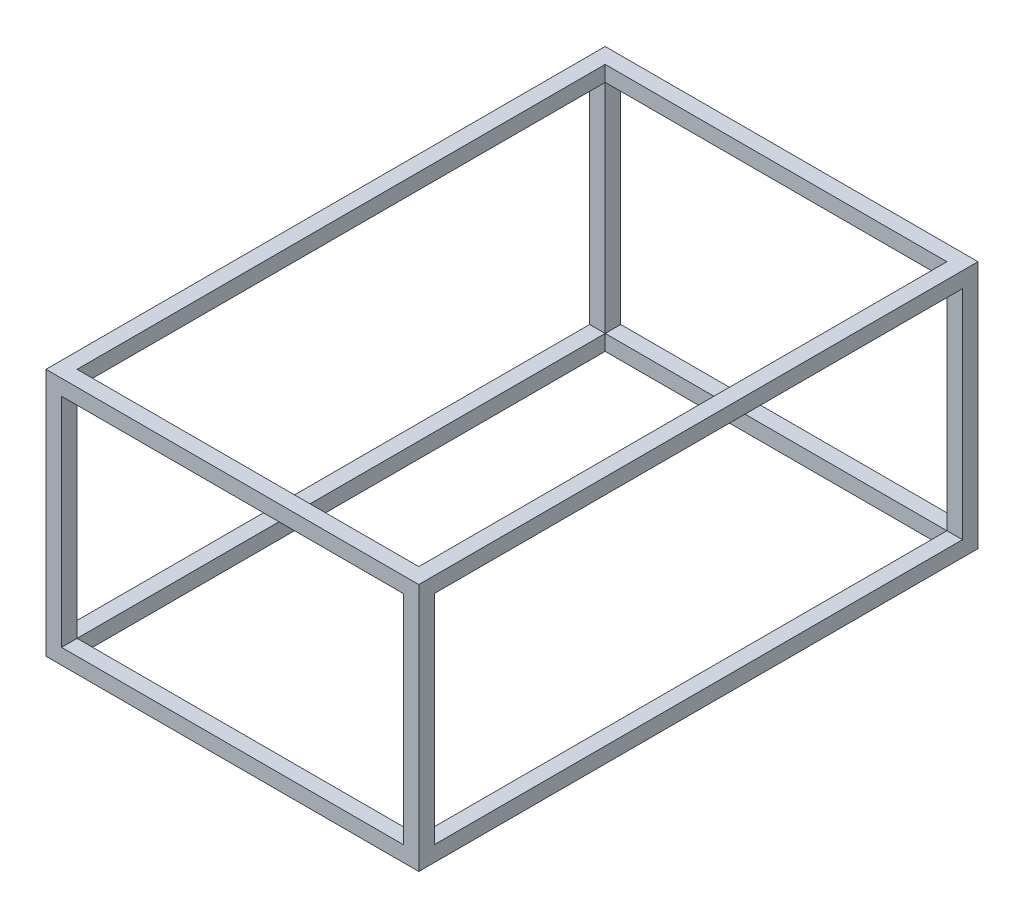
ISO-10303-21;
HEADER;
FILE_DESCRIPTION(('STEP AP214'),'2;1');
FILE_NAME('part.step','',(''),(''),'','','');
FILE_SCHEMA(('AUTOMOTIVE_DESIGN { 1 0 10303 214 1 1 1 1 }'));
ENDSEC;
DATA;
#1=APPLICATION_CONTEXT('core data for automotive mechanical design processes');
#2=APPLICATION_PROTOCOL_DEFINITION('international standard','automotive_design',2000,#1);
#3=PRODUCT_CONTEXT('',#1,'mechanical');
#4=PRODUCT('Part','Part','',(#3));
#5=PRODUCT_RELATED_PRODUCT_CATEGORY('part','',(#4));
#6=PRODUCT_DEFINITION_FORMATION('','',#4);
#7=PRODUCT_DEFINITION_CONTEXT('part definition',#1,'design');
#8=PRODUCT_DEFINITION('design','',#6,#7);
#9=PRODUCT_DEFINITION_SHAPE('','',#8);
#10=(LENGTH_UNIT() NAMED_UNIT(*) SI_UNIT(.MILLI.,.METRE.));
#11=(NAMED_UNIT(*) PLANE_ANGLE_UNIT() SI_UNIT($,.RADIAN.));
#12=(NAMED_UNIT(*) SI_UNIT($,.STERADIAN.) SOLID_ANGLE_UNIT());
#13=UNCERTAINTY_MEASURE_WITH_UNIT(LENGTH_MEASURE(1.E-05),#10,'distance_accuracy_value','');
#14=(GEOMETRIC_REPRESENTATION_CONTEXT(3) GLOBAL_UNCERTAINTY_ASSIGNED_CONTEXT((#13)) GLOBAL_UNIT_ASSIGNED_CONTEXT((#10,
#11,#12)) REPRESENTATION_CONTEXT('',''));
#15=CARTESIAN_POINT('',(0.,0.,0.));
#16=DIRECTION('',(0.,0.,1.));
#17=DIRECTION('',(1.,0.,0.));
#18=AXIS2_PLACEMENT_3D('',#15,#16,#17);
#19=CARTESIAN_POINT('',(-584.2,393.7,-25.4));
#20=DIRECTION('',(0.,0.,1.));
#21=DIRECTION('',(1.,0.,0.));
#22=AXIS2_PLACEMENT_3D('',#19,#20,#21);
#23=PLANE('',#22);
#24=DIRECTION('',(-1.,0.,0.));
#25=VECTOR('',#24,1.);
#26=CARTESIAN_POINT('',(-584.2,368.3,-25.4));
#27=LINE('',#26,#25);
#28=CARTESIAN_POINT('',(-584.2,368.3,-25.4));
#29=VERTEX_POINT('',#28);
#30=CARTESIAN_POINT('',(-609.6,368.3,-25.4));
#31=VERTEX_POINT('',#30);
#32=EDGE_CURVE('E398',#29,#31,#27,.T.);
#33=ORIENTED_EDGE('',*,*,#32,.F.);
#34=DIRECTION('',(0.,-1.,0.));
#35=VECTOR('',#34,1.);
#36=CARTESIAN_POINT('',(-584.2,393.7,-25.4));
#37=LINE('',#36,#35);
#38=CARTESIAN_POINT('',(-584.2,12.7,-25.4));
#39=VERTEX_POINT('',#38);
#40=EDGE_CURVE('E266',#29,#39,#37,.T.);
#41=ORIENTED_EDGE('',*,*,#40,.T.);
#42=DIRECTION('',(-1.,0.,0.));
#43=VECTOR('',#42,1.);
#44=CARTESIAN_POINT('',(-584.2,12.7,-25.4));
#45=LINE('',#44,#43);
#46=CARTESIAN_POINT('',(-609.6,12.7,-25.4));
#47=VERTEX_POINT('',#46);
#48=EDGE_CURVE('E259',#39,#47,#45,.T.);
#49=ORIENTED_EDGE('',*,*,#48,.T.);
#50=DIRECTION('',(0.,-1.,0.));
#51=VECTOR('',#50,1.);
#52=CARTESIAN_POINT('',(-609.6,393.7,-25.4));
#53=LINE('',#52,#51);
#54=EDGE_CURVE('E274',#31,#47,#53,.T.);
#55=ORIENTED_EDGE('',*,*,#54,.F.);
#56=EDGE_LOOP('',(#33,#41,#49,#55));
#57=FACE_BOUND('',#56,.T.);
#58=ADVANCED_FACE('F33',(#57),#23,.F.);
#59=CARTESIAN_POINT('',(-584.2,393.7,-25.4));
#60=DIRECTION('',(-1.,0.,0.));
#61=DIRECTION('',(0.,-1.,0.));
#62=AXIS2_PLACEMENT_3D('',#59,#60,#61);
#63=PLANE('',#62);
#64=DIRECTION('',(0.,0.,-1.));
#65=VECTOR('',#64,1.);
#66=CARTESIAN_POINT('',(-584.2,368.3,-25.4));
#67=LINE('',#66,#65);
#68=CARTESIAN_POINT('',(-584.2,368.3,0.));
#69=VERTEX_POINT('',#68);
#70=EDGE_CURVE('E210',#69,#29,#67,.T.);
#71=ORIENTED_EDGE('',*,*,#70,.F.);
#72=DIRECTION('',(0.,-1.,0.));
#73=VECTOR('',#72,1.);
#74=CARTESIAN_POINT('',(-584.2,393.7,0.));
#75=LINE('',#74,#73);
#76=CARTESIAN_POINT('',(-584.2,12.7,0.));
#77=VERTEX_POINT('',#76);
#78=EDGE_CURVE('E272',#69,#77,#75,.T.);
#79=ORIENTED_EDGE('',*,*,#78,.T.);
#80=DIRECTION('',(0.,0.,-1.));
#81=VECTOR('',#80,1.);
#82=CARTESIAN_POINT('',(-584.2,12.7,-25.4));
#83=LINE('',#82,#81);
#84=EDGE_CURVE('E264',#77,#39,#83,.T.);
#85=ORIENTED_EDGE('',*,*,#84,.T.);
#86=ORIENTED_EDGE('',*,*,#40,.F.);
#87=EDGE_LOOP('',(#71,#79,#85,#86));
#88=FACE_BOUND('',#87,.T.);
#89=ADVANCED_FACE('F451',(#88),#63,.F.);
#90=CARTESIAN_POINT('',(-584.2,393.7,-889.));
#91=DIRECTION('',(0.,0.,-1.));
#92=DIRECTION('',(-1.,0.,0.));
#93=AXIS2_PLACEMENT_3D('',#90,#91,#92);
#94=PLANE('',#93);
#95=DIRECTION('',(1.,0.,0.));
#96=VECTOR('',#95,1.);
#97=CARTESIAN_POINT('',(-584.2,368.3,-889.));
#98=LINE('',#97,#96);
#99=CARTESIAN_POINT('',(-609.6,368.3,-889.));
#100=VERTEX_POINT('',#99);
#101=CARTESIAN_POINT('',(-584.2,368.3,-889.));
#102=VERTEX_POINT('',#101);
#103=EDGE_CURVE('E395',#100,#102,#98,.T.);
#104=ORIENTED_EDGE('',*,*,#103,.F.);
#105=DIRECTION('',(0.,-1.,0.));
#106=VECTOR('',#105,1.);
#107=CARTESIAN_POINT('',(-609.6,393.7,-889.));
#108=LINE('',#107,#106);
#109=CARTESIAN_POINT('',(-609.6,12.7,-889.));
#110=VERTEX_POINT('',#109);
#111=EDGE_CURVE('E248',#100,#110,#108,.T.);
#112=ORIENTED_EDGE('',*,*,#111,.T.);
#113=DIRECTION('',(1.,0.,0.));
#114=VECTOR('',#113,1.);
#115=CARTESIAN_POINT('',(-584.2,12.7,-889.));
#116=LINE('',#115,#114);
#117=CARTESIAN_POINT('',(-584.2,12.7,-889.));
#118=VERTEX_POINT('',#117);
#119=EDGE_CURVE('E244',#110,#118,#116,.T.);
#120=ORIENTED_EDGE('',*,*,#119,.T.);
#121=DIRECTION('',(0.,-1.,0.));
#122=VECTOR('',#121,1.);
#123=CARTESIAN_POINT('',(-584.2,393.7,-889.));
#124=LINE('',#123,#122);
#125=EDGE_CURVE('E257',#102,#118,#124,.T.);
#126=ORIENTED_EDGE('',*,*,#125,.F.);
#127=EDGE_LOOP('',(#104,#112,#120,#126));
#128=FACE_BOUND('',#127,.T.);
#129=ADVANCED_FACE('F442',(#128),#94,.F.);
#130=CARTESIAN_POINT('',(-584.2,393.7,-889.));
#131=DIRECTION('',(-1.,0.,0.));
#132=DIRECTION('',(0.,-1.,0.));
#133=AXIS2_PLACEMENT_3D('',#130,#131,#132);
#134=PLANE('',#133);
#135=DIRECTION('',(0.,0.,-1.));
#136=VECTOR('',#135,1.);
#137=CARTESIAN_POINT('',(-584.2,368.3,-889.));
#138=LINE('',#137,#136);
#139=CARTESIAN_POINT('',(-584.2,368.3,-914.4));
#140=VERTEX_POINT('',#139);
#141=EDGE_CURVE('E393',#102,#140,#138,.T.);
#142=ORIENTED_EDGE('',*,*,#141,.F.);
#143=ORIENTED_EDGE('',*,*,#125,.T.);
#144=DIRECTION('',(0.,0.,-1.));
#145=VECTOR('',#144,1.);
#146=CARTESIAN_POINT('',(-584.2,12.7,-889.));
#147=LINE('',#146,#145);
#148=CARTESIAN_POINT('',(-584.2,12.7,-914.4));
#149=VERTEX_POINT('',#148);
#150=EDGE_CURVE('E249',#118,#149,#147,.T.);
#151=ORIENTED_EDGE('',*,*,#150,.T.);
#152=DIRECTION('',(0.,-1.,0.));
#153=VECTOR('',#152,1.);
#154=CARTESIAN_POINT('',(-584.2,393.7,-914.4));
#155=LINE('',#154,#153);
#156=EDGE_CURVE('E255',#140,#149,#155,.T.);
#157=ORIENTED_EDGE('',*,*,#156,.F.);
#158=EDGE_LOOP('',(#142,#143,#151,#157));
#159=FACE_BOUND('',#158,.T.);
#160=ADVANCED_FACE('F485',(#159),#134,.F.);
#161=CARTESIAN_POINT('',(-25.4,393.7,-889.));
#162=DIRECTION('',(0.,0.,-1.));
#163=DIRECTION('',(-1.,0.,0.));
#164=AXIS2_PLACEMENT_3D('',#161,#162,#163);
#165=PLANE('',#164);
#166=DIRECTION('',(1.,0.,0.));
#167=VECTOR('',#166,1.);
#168=CARTESIAN_POINT('',(-25.4,368.3,-889.));
#169=LINE('',#168,#167);
#170=CARTESIAN_POINT('',(-25.4,368.3,-889.));
#171=VERTEX_POINT('',#170);
#172=CARTESIAN_POINT('',(0.,368.3,-889.));
#173=VERTEX_POINT('',#172);
#174=EDGE_CURVE('E391',#171,#173,#169,.T.);
#175=ORIENTED_EDGE('',*,*,#174,.F.);
#176=DIRECTION('',(0.,-1.,0.));
#177=VECTOR('',#176,1.);
#178=CARTESIAN_POINT('',(-25.4,393.7,-889.));
#179=LINE('',#178,#177);
#180=CARTESIAN_POINT('',(-25.4,12.7,-889.));
#181=VERTEX_POINT('',#180);
#182=EDGE_CURVE('E234',#171,#181,#179,.T.);
#183=ORIENTED_EDGE('',*,*,#182,.T.);
#184=DIRECTION('',(1.,0.,0.));
#185=VECTOR('',#184,1.);
#186=CARTESIAN_POINT('',(-25.4,12.7,-889.));
#187=LINE('',#186,#185);
#188=CARTESIAN_POINT('',(0.,12.7,-889.));
#189=VERTEX_POINT('',#188);
#190=EDGE_CURVE('E225',#181,#189,#187,.T.);
#191=ORIENTED_EDGE('',*,*,#190,.T.);
#192=DIRECTION('',(0.,-1.,0.));
#193=VECTOR('',#192,1.);
#194=CARTESIAN_POINT('',(0.,393.7,-889.));
#195=LINE('',#194,#193);
#196=EDGE_CURVE('E56',#173,#189,#195,.T.);
#197=ORIENTED_EDGE('',*,*,#196,.F.);
#198=EDGE_LOOP('',(#175,#183,#191,#197));
#199=FACE_BOUND('',#198,.T.);
#200=ADVANCED_FACE('F417',(#199),#165,.F.);
#201=CARTESIAN_POINT('',(-25.4,393.7,-889.));
#202=DIRECTION('',(1.,0.,0.));
#203=DIRECTION('',(0.,1.,0.));
#204=AXIS2_PLACEMENT_3D('',#201,#202,#203);
#205=PLANE('',#204);
#206=DIRECTION('',(0.,0.,1.));
#207=VECTOR('',#206,1.);
#208=CARTESIAN_POINT('',(-25.4,368.3,-889.));
#209=LINE('',#208,#207);
#210=CARTESIAN_POINT('',(-25.4,368.3,-914.4));
#211=VERTEX_POINT('',#210);
#212=EDGE_CURVE('E183',#211,#171,#209,.T.);
#213=ORIENTED_EDGE('',*,*,#212,.F.);
#214=DIRECTION('',(0.,-1.,0.));
#215=VECTOR('',#214,1.);
#216=CARTESIAN_POINT('',(-25.4,393.7,-914.4));
#217=LINE('',#216,#215);
#218=CARTESIAN_POINT('',(-25.4,12.7,-914.4));
#219=VERTEX_POINT('',#218);
#220=EDGE_CURVE('E241',#211,#219,#217,.T.);
#221=ORIENTED_EDGE('',*,*,#220,.T.);
#222=DIRECTION('',(0.,0.,1.));
#223=VECTOR('',#222,1.);
#224=CARTESIAN_POINT('',(-25.4,12.7,-889.));
#225=LINE('',#224,#223);
#226=EDGE_CURVE('E235',#219,#181,#225,.T.);
#227=ORIENTED_EDGE('',*,*,#226,.T.);
#228=ORIENTED_EDGE('',*,*,#182,.F.);
#229=EDGE_LOOP('',(#213,#221,#227,#228));
#230=FACE_BOUND('',#229,.T.);
#231=ADVANCED_FACE('F421',(#230),#205,.F.);
#232=CARTESIAN_POINT('',(0.,393.7,-25.4));
#233=DIRECTION('',(0.,0.,1.));
#234=DIRECTION('',(1.,0.,0.));
#235=AXIS2_PLACEMENT_3D('',#232,#233,#234);
#236=PLANE('',#235);
#237=DIRECTION('',(-1.,0.,0.));
#238=VECTOR('',#237,1.);
#239=CARTESIAN_POINT('',(0.,368.3,-25.4));
#240=LINE('',#239,#238);
#241=CARTESIAN_POINT('',(0.,368.3,-25.4));
#242=VERTEX_POINT('',#241);
#243=CARTESIAN_POINT('',(-25.4,368.3,-25.4));
#244=VERTEX_POINT('',#243);
#245=EDGE_CURVE('E173',#242,#244,#240,.T.);
#246=ORIENTED_EDGE('',*,*,#245,.F.);
#247=DIRECTION('',(0.,-1.,0.));
#248=VECTOR('',#247,1.);
#249=CARTESIAN_POINT('',(0.,393.7,-25.4));
#250=LINE('',#249,#248);
#251=CARTESIAN_POINT('',(0.,12.7,-25.4));
#252=VERTEX_POINT('',#251);
#253=EDGE_CURVE('E223',#242,#252,#250,.T.);
#254=ORIENTED_EDGE('',*,*,#253,.T.);
#255=DIRECTION('',(-1.,0.,0.));
#256=VECTOR('',#255,1.);
#257=CARTESIAN_POINT('',(0.,12.7,-25.4));
#258=LINE('',#257,#256);
#259=CARTESIAN_POINT('',(-25.4,12.7,-25.4));
#260=VERTEX_POINT('',#259);
#261=EDGE_CURVE('E222',#252,#260,#258,.T.);
#262=ORIENTED_EDGE('',*,*,#261,.T.);
#263=DIRECTION('',(0.,-1.,0.));
#264=VECTOR('',#263,1.);
#265=CARTESIAN_POINT('',(-25.4,393.7,-25.4));
#266=LINE('',#265,#264);
#267=EDGE_CURVE('E217',#244,#260,#266,.T.);
#268=ORIENTED_EDGE('',*,*,#267,.F.);
#269=EDGE_LOOP('',(#246,#254,#262,#268));
#270=FACE_BOUND('',#269,.T.);
#271=ADVANCED_FACE('F220',(#270),#236,.F.);
#272=CARTESIAN_POINT('',(-25.4,393.7,0.));
#273=DIRECTION('',(1.,0.,0.));
#274=DIRECTION('',(0.,1.,0.));
#275=AXIS2_PLACEMENT_3D('',#272,#273,#274);
#276=PLANE('',#275);
#277=DIRECTION('',(0.,0.,1.));
#278=VECTOR('',#277,1.);
#279=CARTESIAN_POINT('',(-25.4,368.3,0.));
#280=LINE('',#279,#278);
#281=CARTESIAN_POINT('',(-25.4,368.3,0.));
#282=VERTEX_POINT('',#281);
#283=EDGE_CURVE('E11',#244,#282,#280,.T.);
#284=ORIENTED_EDGE('',*,*,#283,.F.);
#285=ORIENTED_EDGE('',*,*,#267,.T.);
#286=DIRECTION('',(0.,0.,1.));
#287=VECTOR('',#286,1.);
#288=CARTESIAN_POINT('',(-25.4,12.7,0.));
#289=LINE('',#288,#287);
#290=CARTESIAN_POINT('',(-25.4,12.7,0.));
#291=VERTEX_POINT('',#290);
#292=EDGE_CURVE('E227',#260,#291,#289,.T.);
#293=ORIENTED_EDGE('',*,*,#292,.T.);
#294=DIRECTION('',(0.,-1.,0.));
#295=VECTOR('',#294,1.);
#296=CARTESIAN_POINT('',(-25.4,393.7,0.));
#297=LINE('',#296,#295);
#298=EDGE_CURVE('E48',#282,#291,#297,.T.);
#299=ORIENTED_EDGE('',*,*,#298,.F.);
#300=EDGE_LOOP('',(#284,#285,#293,#299));
#301=FACE_BOUND('',#300,.T.);
#302=ADVANCED_FACE('F215',(#301),#276,.F.);
#303=CARTESIAN_POINT('',(0.,12.7,0.));
#304=DIRECTION('',(0.,-1.,0.));
#305=DIRECTION('',(0.,0.,-1.));
#306=AXIS2_PLACEMENT_3D('',#303,#304,#305);
#307=PLANE('',#306);
#308=ORIENTED_EDGE('',*,*,#261,.F.);
#309=DIRECTION('',(0.,0.,-1.));
#310=VECTOR('',#309,1.);
#311=CARTESIAN_POINT('',(0.,12.7,0.));
#312=LINE('',#311,#310);
#313=EDGE_CURVE('E313',#252,#189,#312,.T.);
#314=ORIENTED_EDGE('',*,*,#313,.T.);
#315=ORIENTED_EDGE('',*,*,#190,.F.);
#316=DIRECTION('',(0.,0.,-1.));
#317=VECTOR('',#316,1.);
#318=CARTESIAN_POINT('',(-25.4,12.7,-25.4));
#319=LINE('',#318,#317);
#320=EDGE_CURVE('E277',#260,#181,#319,.T.);
#321=ORIENTED_EDGE('',*,*,#320,.F.);
#322=EDGE_LOOP('',(#308,#314,#315,#321));
#323=FACE_BOUND('',#322,.T.);
#324=ADVANCED_FACE('F415',(#323),#307,.F.);
#325=ORIENTED_EDGE('',*,*,#292,.F.);
#326=DIRECTION('',(1.,0.,0.));
#327=VECTOR('',#326,1.);
#328=CARTESIAN_POINT('',(-25.4,12.7,-25.4));
#329=LINE('',#328,#327);
#330=EDGE_CURVE('E287',#39,#260,#329,.T.);
#331=ORIENTED_EDGE('',*,*,#330,.F.);
#332=ORIENTED_EDGE('',*,*,#84,.F.);
#333=DIRECTION('',(1.,0.,0.));
#334=VECTOR('',#333,1.);
#335=CARTESIAN_POINT('',(0.,12.7,0.));
#336=LINE('',#335,#334);
#337=EDGE_CURVE('E311',#77,#291,#336,.T.);
#338=ORIENTED_EDGE('',*,*,#337,.T.);
#339=EDGE_LOOP('',(#325,#331,#332,#338));
#340=FACE_BOUND('',#339,.T.);
#341=ADVANCED_FACE('F402',(#340),#307,.F.);
#342=ORIENTED_EDGE('',*,*,#226,.F.);
#343=DIRECTION('',(-1.,0.,0.));
#344=VECTOR('',#343,1.);
#345=CARTESIAN_POINT('',(0.,12.7,-914.4));
#346=LINE('',#345,#344);
#347=EDGE_CURVE('E316',#219,#149,#346,.T.);
#348=ORIENTED_EDGE('',*,*,#347,.T.);
#349=ORIENTED_EDGE('',*,*,#150,.F.);
#350=DIRECTION('',(-1.,0.,0.));
#351=VECTOR('',#350,1.);
#352=CARTESIAN_POINT('',(-25.4,12.7,-889.));
#353=LINE('',#352,#351);
#354=EDGE_CURVE('E280',#181,#118,#353,.T.);
#355=ORIENTED_EDGE('',*,*,#354,.F.);
#356=EDGE_LOOP('',(#342,#348,#349,#355));
#357=FACE_BOUND('',#356,.T.);
#358=ADVANCED_FACE('F427',(#357),#307,.F.);
#359=ORIENTED_EDGE('',*,*,#119,.F.);
#360=DIRECTION('',(0.,0.,1.));
#361=VECTOR('',#360,1.);
#362=CARTESIAN_POINT('',(-609.6,12.7,0.));
#363=LINE('',#362,#361);
#364=EDGE_CURVE('E319',#110,#47,#363,.T.);
#365=ORIENTED_EDGE('',*,*,#364,.T.);
#366=ORIENTED_EDGE('',*,*,#48,.F.);
#367=DIRECTION('',(0.,0.,1.));
#368=VECTOR('',#367,1.);
#369=CARTESIAN_POINT('',(-584.2,12.7,-25.4));
#370=LINE('',#369,#368);
#371=EDGE_CURVE('E284',#118,#39,#370,.T.);
#372=ORIENTED_EDGE('',*,*,#371,.F.);
#373=EDGE_LOOP('',(#359,#365,#366,#372));
#374=FACE_BOUND('',#373,.T.);
#375=ADVANCED_FACE('F438',(#374),#307,.F.);
#376=CARTESIAN_POINT('',(0.,-12.7,0.));
#377=DIRECTION('',(0.,-1.,0.));
#378=DIRECTION('',(0.,0.,-1.));
#379=AXIS2_PLACEMENT_3D('',#376,#377,#378);
#380=PLANE('',#379);
#381=DIRECTION('',(1.,0.,0.));
#382=VECTOR('',#381,1.);
#383=CARTESIAN_POINT('',(0.,-12.7,0.));
#384=LINE('',#383,#382);
#385=CARTESIAN_POINT('',(-609.6,-12.7,0.));
#386=VERTEX_POINT('',#385);
#387=CARTESIAN_POINT('',(0.,-12.7,0.));
#388=VERTEX_POINT('',#387);
#389=EDGE_CURVE('E310',#386,#388,#384,.T.);
#390=ORIENTED_EDGE('',*,*,#389,.F.);
#391=DIRECTION('',(0.,0.,1.));
#392=VECTOR('',#391,1.);
#393=CARTESIAN_POINT('',(-609.6,-12.7,0.));
#394=LINE('',#393,#392);
#395=CARTESIAN_POINT('',(-609.6,-12.7,-914.4));
#396=VERTEX_POINT('',#395);
#397=EDGE_CURVE('E314',#396,#386,#394,.T.);
#398=ORIENTED_EDGE('',*,*,#397,.F.);
#399=DIRECTION('',(-1.,0.,0.));
#400=VECTOR('',#399,1.);
#401=CARTESIAN_POINT('',(0.,-12.7,-914.4));
#402=LINE('',#401,#400);
#403=CARTESIAN_POINT('',(0.,-12.7,-914.4));
#404=VERTEX_POINT('',#403);
#405=EDGE_CURVE('E328',#404,#396,#402,.T.);
#406=ORIENTED_EDGE('',*,*,#405,.F.);
#407=DIRECTION('',(0.,0.,-1.));
#408=VECTOR('',#407,1.);
#409=CARTESIAN_POINT('',(0.,-12.7,0.));
#410=LINE('',#409,#408);
#411=EDGE_CURVE('E325',#388,#404,#410,.T.);
#412=ORIENTED_EDGE('',*,*,#411,.F.);
#413=EDGE_LOOP('',(#390,#398,#406,#412));
#414=FACE_BOUND('',#413,.T.);
#415=DIRECTION('',(1.,0.,0.));
#416=VECTOR('',#415,1.);
#417=CARTESIAN_POINT('',(-25.4,-12.7,-25.4));
#418=LINE('',#417,#416);
#419=CARTESIAN_POINT('',(-584.2,-12.7,-25.4));
#420=VERTEX_POINT('',#419);
#421=CARTESIAN_POINT('',(-25.4,-12.7,-25.4));
#422=VERTEX_POINT('',#421);
#423=EDGE_CURVE('E281',#420,#422,#418,.T.);
#424=ORIENTED_EDGE('',*,*,#423,.T.);
#425=DIRECTION('',(0.,0.,-1.));
#426=VECTOR('',#425,1.);
#427=CARTESIAN_POINT('',(-25.4,-12.7,-25.4));
#428=LINE('',#427,#426);
#429=CARTESIAN_POINT('',(-25.4,-12.7,-889.));
#430=VERTEX_POINT('',#429);
#431=EDGE_CURVE('E276',#422,#430,#428,.T.);
#432=ORIENTED_EDGE('',*,*,#431,.T.);
#433=DIRECTION('',(-1.,0.,0.));
#434=VECTOR('',#433,1.);
#435=CARTESIAN_POINT('',(-25.4,-12.7,-889.));
#436=LINE('',#435,#434);
#437=CARTESIAN_POINT('',(-584.2,-12.7,-889.));
#438=VERTEX_POINT('',#437);
#439=EDGE_CURVE('E293',#430,#438,#436,.T.);
#440=ORIENTED_EDGE('',*,*,#439,.T.);
#441=DIRECTION('',(0.,0.,1.));
#442=VECTOR('',#441,1.);
#443=CARTESIAN_POINT('',(-584.2,-12.7,-25.4));
#444=LINE('',#443,#442);
#445=EDGE_CURVE('E296',#438,#420,#444,.T.);
#446=ORIENTED_EDGE('',*,*,#445,.T.);
#447=EDGE_LOOP('',(#424,#432,#440,#446));
#448=FACE_BOUND('',#447,.T.);
#449=ADVANCED_FACE('F348',(#414,#448),#380,.T.);
#450=CARTESIAN_POINT('',(0.,12.7,0.));
#451=DIRECTION('',(0.,0.,-1.));
#452=DIRECTION('',(-1.,0.,0.));
#453=AXIS2_PLACEMENT_3D('',#450,#451,#452);
#454=PLANE('',#453);
#455=ORIENTED_EDGE('',*,*,#78,.F.);
#456=DIRECTION('',(1.,0.,0.));
#457=VECTOR('',#456,1.);
#458=CARTESIAN_POINT('',(0.,368.3,0.));
#459=LINE('',#458,#457);
#460=EDGE_CURVE('E387',#69,#282,#459,.T.);
#461=ORIENTED_EDGE('',*,*,#460,.T.);
#462=ORIENTED_EDGE('',*,*,#298,.T.);
#463=ORIENTED_EDGE('',*,*,#337,.F.);
#464=EDGE_LOOP('',(#455,#461,#462,#463));
#465=FACE_BOUND('',#464,.T.);
#466=DIRECTION('',(0.,-1.,0.));
#467=VECTOR('',#466,1.);
#468=CARTESIAN_POINT('',(0.,12.7,0.));
#469=LINE('',#468,#467);
#470=CARTESIAN_POINT('',(0.,393.7,0.));
#471=VERTEX_POINT('',#470);
#472=EDGE_CURVE('E41',#471,#388,#469,.T.);
#473=ORIENTED_EDGE('',*,*,#472,.F.);
#474=DIRECTION('',(1.,0.,0.));
#475=VECTOR('',#474,1.);
#476=CARTESIAN_POINT('',(-584.2,393.7,0.));
#477=LINE('',#476,#475);
#478=CARTESIAN_POINT('',(-609.6,393.7,0.));
#479=VERTEX_POINT('',#478);
#480=EDGE_CURVE('E263',#479,#471,#477,.T.);
#481=ORIENTED_EDGE('',*,*,#480,.F.);
#482=DIRECTION('',(0.,-1.,0.));
#483=VECTOR('',#482,1.);
#484=CARTESIAN_POINT('',(-609.6,12.7,0.));
#485=LINE('',#484,#483);
#486=EDGE_CURVE('E322',#479,#386,#485,.T.);
#487=ORIENTED_EDGE('',*,*,#486,.T.);
#488=ORIENTED_EDGE('',*,*,#389,.T.);
#489=EDGE_LOOP('',(#473,#481,#487,#488));
#490=FACE_BOUND('',#489,.T.);
#491=ADVANCED_FACE('F35',(#465,#490),#454,.F.);
#492=CARTESIAN_POINT('',(0.,12.7,0.));
#493=DIRECTION('',(-1.,0.,0.));
#494=DIRECTION('',(0.,0.,1.));
#495=AXIS2_PLACEMENT_3D('',#492,#493,#494);
#496=PLANE('',#495);
#497=ORIENTED_EDGE('',*,*,#253,.F.);
#498=DIRECTION('',(0.,0.,-1.));
#499=VECTOR('',#498,1.);
#500=CARTESIAN_POINT('',(0.,368.3,-914.4));
#501=LINE('',#500,#499);
#502=EDGE_CURVE('E179',#242,#173,#501,.T.);
#503=ORIENTED_EDGE('',*,*,#502,.T.);
#504=ORIENTED_EDGE('',*,*,#196,.T.);
#505=ORIENTED_EDGE('',*,*,#313,.F.);
#506=EDGE_LOOP('',(#497,#503,#504,#505));
#507=FACE_BOUND('',#506,.T.);
#508=DIRECTION('',(0.,0.,-1.));
#509=VECTOR('',#508,1.);
#510=CARTESIAN_POINT('',(0.,393.7,-889.));
#511=LINE('',#510,#509);
#512=CARTESIAN_POINT('',(0.,393.7,-914.4));
#513=VERTEX_POINT('',#512);
#514=EDGE_CURVE('E231',#471,#513,#511,.T.);
#515=ORIENTED_EDGE('',*,*,#514,.F.);
#516=ORIENTED_EDGE('',*,*,#472,.T.);
#517=ORIENTED_EDGE('',*,*,#411,.T.);
#518=DIRECTION('',(0.,-1.,0.));
#519=VECTOR('',#518,1.);
#520=CARTESIAN_POINT('',(0.,12.7,-914.4));
#521=LINE('',#520,#519);
#522=EDGE_CURVE('E336',#513,#404,#521,.T.);
#523=ORIENTED_EDGE('',*,*,#522,.F.);
#524=EDGE_LOOP('',(#515,#516,#517,#523));
#525=FACE_BOUND('',#524,.T.);
#526=ADVANCED_FACE('F341',(#507,#525),#496,.F.);
#527=CARTESIAN_POINT('',(0.,12.7,-914.4));
#528=DIRECTION('',(0.,0.,1.));
#529=DIRECTION('',(1.,0.,0.));
#530=AXIS2_PLACEMENT_3D('',#527,#528,#529);
#531=PLANE('',#530);
#532=ORIENTED_EDGE('',*,*,#220,.F.);
#533=DIRECTION('',(-1.,0.,0.));
#534=VECTOR('',#533,1.);
#535=CARTESIAN_POINT('',(0.,368.3,-914.4));
#536=LINE('',#535,#534);
#537=EDGE_CURVE('E376',#211,#140,#536,.T.);
#538=ORIENTED_EDGE('',*,*,#537,.T.);
#539=ORIENTED_EDGE('',*,*,#156,.T.);
#540=ORIENTED_EDGE('',*,*,#347,.F.);
#541=EDGE_LOOP('',(#532,#538,#539,#540));
#542=FACE_BOUND('',#541,.T.);
#543=DIRECTION('',(-1.,0.,0.));
#544=VECTOR('',#543,1.);
#545=CARTESIAN_POINT('',(-584.2,393.7,-914.4));
#546=LINE('',#545,#544);
#547=CARTESIAN_POINT('',(-609.6,393.7,-914.4));
#548=VERTEX_POINT('',#547);
#549=EDGE_CURVE('E245',#513,#548,#546,.T.);
#550=ORIENTED_EDGE('',*,*,#549,.F.);
#551=ORIENTED_EDGE('',*,*,#522,.T.);
#552=ORIENTED_EDGE('',*,*,#405,.T.);
#553=DIRECTION('',(0.,-1.,0.));
#554=VECTOR('',#553,1.);
#555=CARTESIAN_POINT('',(-609.6,12.7,-914.4));
#556=LINE('',#555,#554);
#557=EDGE_CURVE('E334',#548,#396,#556,.T.);
#558=ORIENTED_EDGE('',*,*,#557,.F.);
#559=EDGE_LOOP('',(#550,#551,#552,#558));
#560=FACE_BOUND('',#559,.T.);
#561=ADVANCED_FACE('F355',(#542,#560),#531,.F.);
#562=CARTESIAN_POINT('',(-609.6,12.7,0.));
#563=DIRECTION('',(1.,0.,0.));
#564=DIRECTION('',(0.,0.,-1.));
#565=AXIS2_PLACEMENT_3D('',#562,#563,#564);
#566=PLANE('',#565);
#567=ORIENTED_EDGE('',*,*,#111,.F.);
#568=DIRECTION('',(0.,0.,1.));
#569=VECTOR('',#568,1.);
#570=CARTESIAN_POINT('',(-609.6,368.3,-914.4));
#571=LINE('',#570,#569);
#572=EDGE_CURVE('E379',#100,#31,#571,.T.);
#573=ORIENTED_EDGE('',*,*,#572,.T.);
#574=ORIENTED_EDGE('',*,*,#54,.T.);
#575=ORIENTED_EDGE('',*,*,#364,.F.);
#576=EDGE_LOOP('',(#567,#573,#574,#575));
#577=FACE_BOUND('',#576,.T.);
#578=DIRECTION('',(0.,0.,1.));
#579=VECTOR('',#578,1.);
#580=CARTESIAN_POINT('',(-609.6,393.7,-25.4));
#581=LINE('',#580,#579);
#582=EDGE_CURVE('E260',#548,#479,#581,.T.);
#583=ORIENTED_EDGE('',*,*,#582,.F.);
#584=ORIENTED_EDGE('',*,*,#557,.T.);
#585=ORIENTED_EDGE('',*,*,#397,.T.);
#586=ORIENTED_EDGE('',*,*,#486,.F.);
#587=EDGE_LOOP('',(#583,#584,#585,#586));
#588=FACE_BOUND('',#587,.T.);
#589=ADVANCED_FACE('F352',(#577,#588),#566,.F.);
#590=CARTESIAN_POINT('',(-25.4,12.7,-25.4));
#591=DIRECTION('',(-1.,0.,0.));
#592=DIRECTION('',(0.,0.,1.));
#593=AXIS2_PLACEMENT_3D('',#590,#591,#592);
#594=PLANE('',#593);
#595=ORIENTED_EDGE('',*,*,#431,.F.);
#596=DIRECTION('',(0.,-1.,0.));
#597=VECTOR('',#596,1.);
#598=CARTESIAN_POINT('',(-25.4,12.7,-25.4));
#599=LINE('',#598,#597);
#600=EDGE_CURVE('E290',#260,#422,#599,.T.);
#601=ORIENTED_EDGE('',*,*,#600,.F.);
#602=ORIENTED_EDGE('',*,*,#320,.T.);
#603=DIRECTION('',(0.,-1.,0.));
#604=VECTOR('',#603,1.);
#605=CARTESIAN_POINT('',(-25.4,12.7,-889.));
#606=LINE('',#605,#604);
#607=EDGE_CURVE('E307',#181,#430,#606,.T.);
#608=ORIENTED_EDGE('',*,*,#607,.T.);
#609=EDGE_LOOP('',(#595,#601,#602,#608));
#610=FACE_BOUND('',#609,.T.);
#611=ADVANCED_FACE('F411',(#610),#594,.T.);
#612=CARTESIAN_POINT('',(-25.4,12.7,-889.));
#613=DIRECTION('',(0.,0.,1.));
#614=DIRECTION('',(1.,0.,0.));
#615=AXIS2_PLACEMENT_3D('',#612,#613,#614);
#616=PLANE('',#615);
#617=ORIENTED_EDGE('',*,*,#439,.F.);
#618=ORIENTED_EDGE('',*,*,#607,.F.);
#619=ORIENTED_EDGE('',*,*,#354,.T.);
#620=DIRECTION('',(0.,-1.,0.));
#621=VECTOR('',#620,1.);
#622=CARTESIAN_POINT('',(-584.2,12.7,-889.));
#623=LINE('',#622,#621);
#624=EDGE_CURVE('E305',#118,#438,#623,.T.);
#625=ORIENTED_EDGE('',*,*,#624,.T.);
#626=EDGE_LOOP('',(#617,#618,#619,#625));
#627=FACE_BOUND('',#626,.T.);
#628=ADVANCED_FACE('F431',(#627),#616,.T.);
#629=CARTESIAN_POINT('',(-584.2,12.7,-25.4));
#630=DIRECTION('',(1.,0.,0.));
#631=DIRECTION('',(0.,0.,-1.));
#632=AXIS2_PLACEMENT_3D('',#629,#630,#631);
#633=PLANE('',#632);
#634=ORIENTED_EDGE('',*,*,#445,.F.);
#635=ORIENTED_EDGE('',*,*,#624,.F.);
#636=ORIENTED_EDGE('',*,*,#371,.T.);
#637=DIRECTION('',(0.,-1.,0.));
#638=VECTOR('',#637,1.);
#639=CARTESIAN_POINT('',(-584.2,12.7,-25.4));
#640=LINE('',#639,#638);
#641=EDGE_CURVE('E303',#39,#420,#640,.T.);
#642=ORIENTED_EDGE('',*,*,#641,.T.);
#643=EDGE_LOOP('',(#634,#635,#636,#642));
#644=FACE_BOUND('',#643,.T.);
#645=ADVANCED_FACE('F435',(#644),#633,.T.);
#646=CARTESIAN_POINT('',(-25.4,12.7,-25.4));
#647=DIRECTION('',(0.,0.,-1.));
#648=DIRECTION('',(-1.,0.,0.));
#649=AXIS2_PLACEMENT_3D('',#646,#647,#648);
#650=PLANE('',#649);
#651=ORIENTED_EDGE('',*,*,#423,.F.);
#652=ORIENTED_EDGE('',*,*,#641,.F.);
#653=ORIENTED_EDGE('',*,*,#330,.T.);
#654=ORIENTED_EDGE('',*,*,#600,.T.);
#655=EDGE_LOOP('',(#651,#652,#653,#654));
#656=FACE_BOUND('',#655,.T.);
#657=ADVANCED_FACE('F361',(#656),#650,.T.);
#658=CARTESIAN_POINT('',(0.,393.7,0.));
#659=DIRECTION('',(0.,1.,0.));
#660=DIRECTION('',(-1.,0.,0.));
#661=AXIS2_PLACEMENT_3D('',#658,#659,#660);
#662=PLANE('',#661);
#663=ORIENTED_EDGE('',*,*,#549,.T.);
#664=ORIENTED_EDGE('',*,*,#582,.T.);
#665=ORIENTED_EDGE('',*,*,#480,.T.);
#666=ORIENTED_EDGE('',*,*,#514,.T.);
#667=EDGE_LOOP('',(#663,#664,#665,#666));
#668=FACE_BOUND('',#667,.T.);
#669=DIRECTION('',(1.,0.,0.));
#670=VECTOR('',#669,1.);
#671=CARTESIAN_POINT('',(-584.2,393.7,-25.4));
#672=LINE('',#671,#670);
#673=CARTESIAN_POINT('',(-584.2,393.7,-25.4));
#674=VERTEX_POINT('',#673);
#675=CARTESIAN_POINT('',(-25.4,393.7,-25.4));
#676=VERTEX_POINT('',#675);
#677=EDGE_CURVE('E194',#674,#676,#672,.T.);
#678=ORIENTED_EDGE('',*,*,#677,.F.);
#679=DIRECTION('',(0.,0.,1.));
#680=VECTOR('',#679,1.);
#681=CARTESIAN_POINT('',(-584.2,393.7,-25.4));
#682=LINE('',#681,#680);
#683=CARTESIAN_POINT('',(-584.2,393.7,-889.));
#684=VERTEX_POINT('',#683);
#685=EDGE_CURVE('E212',#684,#674,#682,.T.);
#686=ORIENTED_EDGE('',*,*,#685,.F.);
#687=DIRECTION('',(-1.,0.,0.));
#688=VECTOR('',#687,1.);
#689=CARTESIAN_POINT('',(-584.2,393.7,-889.));
#690=LINE('',#689,#688);
#691=CARTESIAN_POINT('',(-25.4,393.7,-889.));
#692=VERTEX_POINT('',#691);
#693=EDGE_CURVE('E374',#692,#684,#690,.T.);
#694=ORIENTED_EDGE('',*,*,#693,.F.);
#695=DIRECTION('',(0.,0.,-1.));
#696=VECTOR('',#695,1.);
#697=CARTESIAN_POINT('',(-25.4,393.7,-25.4));
#698=LINE('',#697,#696);
#699=EDGE_CURVE('E365',#676,#692,#698,.T.);
#700=ORIENTED_EDGE('',*,*,#699,.F.);
#701=EDGE_LOOP('',(#678,#686,#694,#700));
#702=FACE_BOUND('',#701,.T.);
#703=ADVANCED_FACE('F357',(#668,#702),#662,.T.);
#704=CARTESIAN_POINT('',(0.,368.3,0.));
#705=DIRECTION('',(0.,1.,0.));
#706=DIRECTION('',(-1.,0.,0.));
#707=AXIS2_PLACEMENT_3D('',#704,#705,#706);
#708=PLANE('',#707);
#709=DIRECTION('',(0.,0.,1.));
#710=VECTOR('',#709,1.);
#711=CARTESIAN_POINT('',(-584.2,368.3,-25.4));
#712=LINE('',#711,#710);
#713=EDGE_CURVE('E199',#102,#29,#712,.T.);
#714=ORIENTED_EDGE('',*,*,#713,.T.);
#715=ORIENTED_EDGE('',*,*,#32,.T.);
#716=ORIENTED_EDGE('',*,*,#572,.F.);
#717=ORIENTED_EDGE('',*,*,#103,.T.);
#718=EDGE_LOOP('',(#714,#715,#716,#717));
#719=FACE_BOUND('',#718,.T.);
#720=ADVANCED_FACE('F360',(#719),#708,.F.);
#721=ORIENTED_EDGE('',*,*,#460,.F.);
#722=ORIENTED_EDGE('',*,*,#70,.T.);
#723=DIRECTION('',(1.,0.,0.));
#724=VECTOR('',#723,1.);
#725=CARTESIAN_POINT('',(-584.2,368.3,-25.4));
#726=LINE('',#725,#724);
#727=EDGE_CURVE('E192',#29,#244,#726,.T.);
#728=ORIENTED_EDGE('',*,*,#727,.T.);
#729=ORIENTED_EDGE('',*,*,#283,.T.);
#730=EDGE_LOOP('',(#721,#722,#728,#729));
#731=FACE_BOUND('',#730,.T.);
#732=ADVANCED_FACE('F208',(#731),#708,.F.);
#733=DIRECTION('',(-1.,0.,0.));
#734=VECTOR('',#733,1.);
#735=CARTESIAN_POINT('',(-584.2,368.3,-889.));
#736=LINE('',#735,#734);
#737=EDGE_CURVE('E204',#171,#102,#736,.T.);
#738=ORIENTED_EDGE('',*,*,#737,.T.);
#739=ORIENTED_EDGE('',*,*,#141,.T.);
#740=ORIENTED_EDGE('',*,*,#537,.F.);
#741=ORIENTED_EDGE('',*,*,#212,.T.);
#742=EDGE_LOOP('',(#738,#739,#740,#741));
#743=FACE_BOUND('',#742,.T.);
#744=ADVANCED_FACE('F488',(#743),#708,.F.);
#745=DIRECTION('',(0.,0.,-1.));
#746=VECTOR('',#745,1.);
#747=CARTESIAN_POINT('',(-25.4,368.3,-25.4));
#748=LINE('',#747,#746);
#749=EDGE_CURVE('E177',#244,#171,#748,.T.);
#750=ORIENTED_EDGE('',*,*,#749,.T.);
#751=ORIENTED_EDGE('',*,*,#174,.T.);
#752=ORIENTED_EDGE('',*,*,#502,.F.);
#753=ORIENTED_EDGE('',*,*,#245,.T.);
#754=EDGE_LOOP('',(#750,#751,#752,#753));
#755=FACE_BOUND('',#754,.T.);
#756=ADVANCED_FACE('F175',(#755),#708,.F.);
#757=CARTESIAN_POINT('',(-584.2,368.3,-25.4));
#758=DIRECTION('',(0.,0.,1.));
#759=DIRECTION('',(1.,0.,0.));
#760=AXIS2_PLACEMENT_3D('',#757,#758,#759);
#761=PLANE('',#760);
#762=ORIENTED_EDGE('',*,*,#677,.T.);
#763=DIRECTION('',(0.,1.,0.));
#764=VECTOR('',#763,1.);
#765=CARTESIAN_POINT('',(-25.4,368.3,-25.4));
#766=LINE('',#765,#764);
#767=EDGE_CURVE('E188',#244,#676,#766,.T.);
#768=ORIENTED_EDGE('',*,*,#767,.F.);
#769=ORIENTED_EDGE('',*,*,#727,.F.);
#770=DIRECTION('',(0.,1.,0.));
#771=VECTOR('',#770,1.);
#772=CARTESIAN_POINT('',(-584.2,368.3,-25.4));
#773=LINE('',#772,#771);
#774=EDGE_CURVE('E370',#29,#674,#773,.T.);
#775=ORIENTED_EDGE('',*,*,#774,.T.);
#776=EDGE_LOOP('',(#762,#768,#769,#775));
#777=FACE_BOUND('',#776,.T.);
#778=ADVANCED_FACE('F189',(#777),#761,.F.);
#779=CARTESIAN_POINT('',(-584.2,368.3,-25.4));
#780=DIRECTION('',(-1.,0.,0.));
#781=DIRECTION('',(0.,-1.,0.));
#782=AXIS2_PLACEMENT_3D('',#779,#780,#781);
#783=PLANE('',#782);
#784=ORIENTED_EDGE('',*,*,#685,.T.);
#785=ORIENTED_EDGE('',*,*,#774,.F.);
#786=ORIENTED_EDGE('',*,*,#713,.F.);
#787=DIRECTION('',(0.,1.,0.));
#788=VECTOR('',#787,1.);
#789=CARTESIAN_POINT('',(-584.2,368.3,-889.));
#790=LINE('',#789,#788);
#791=EDGE_CURVE('E372',#102,#684,#790,.T.);
#792=ORIENTED_EDGE('',*,*,#791,.T.);
#793=EDGE_LOOP('',(#784,#785,#786,#792));
#794=FACE_BOUND('',#793,.T.);
#795=ADVANCED_FACE('F368',(#794),#783,.F.);
#796=CARTESIAN_POINT('',(-584.2,368.3,-889.));
#797=DIRECTION('',(0.,0.,-1.));
#798=DIRECTION('',(-1.,0.,0.));
#799=AXIS2_PLACEMENT_3D('',#796,#797,#798);
#800=PLANE('',#799);
#801=ORIENTED_EDGE('',*,*,#693,.T.);
#802=ORIENTED_EDGE('',*,*,#791,.F.);
#803=ORIENTED_EDGE('',*,*,#737,.F.);
#804=DIRECTION('',(0.,1.,0.));
#805=VECTOR('',#804,1.);
#806=CARTESIAN_POINT('',(-25.4,368.3,-889.));
#807=LINE('',#806,#805);
#808=EDGE_CURVE('E198',#171,#692,#807,.T.);
#809=ORIENTED_EDGE('',*,*,#808,.T.);
#810=EDGE_LOOP('',(#801,#802,#803,#809));
#811=FACE_BOUND('',#810,.T.);
#812=ADVANCED_FACE('F494',(#811),#800,.F.);
#813=CARTESIAN_POINT('',(-25.4,368.3,-25.4));
#814=DIRECTION('',(1.,0.,0.));
#815=DIRECTION('',(0.,1.,0.));
#816=AXIS2_PLACEMENT_3D('',#813,#814,#815);
#817=PLANE('',#816);
#818=ORIENTED_EDGE('',*,*,#699,.T.);
#819=ORIENTED_EDGE('',*,*,#808,.F.);
#820=ORIENTED_EDGE('',*,*,#749,.F.);
#821=ORIENTED_EDGE('',*,*,#767,.T.);
#822=EDGE_LOOP('',(#818,#819,#820,#821));
#823=FACE_BOUND('',#822,.T.);
#824=ADVANCED_FACE('F202',(#823),#817,.F.);
#825=CLOSED_SHELL('',(#58,#89,#129,#160,#200,#231,#271,#302,#324,#341,#358,#375,#449,#491,#526,
#561,#589,#611,#628,#645,#657,#703,#720,#732,#744,#756,#778,#795,#812,#824));
#826=MANIFOLD_SOLID_BREP('B2',#825);
#827=ADVANCED_BREP_SHAPE_REPRESENTATION('',(#18,#826),#14);
#828=SHAPE_DEFINITION_REPRESENTATION(#9,#827);
ENDSEC;
END-ISO-10303-21;
